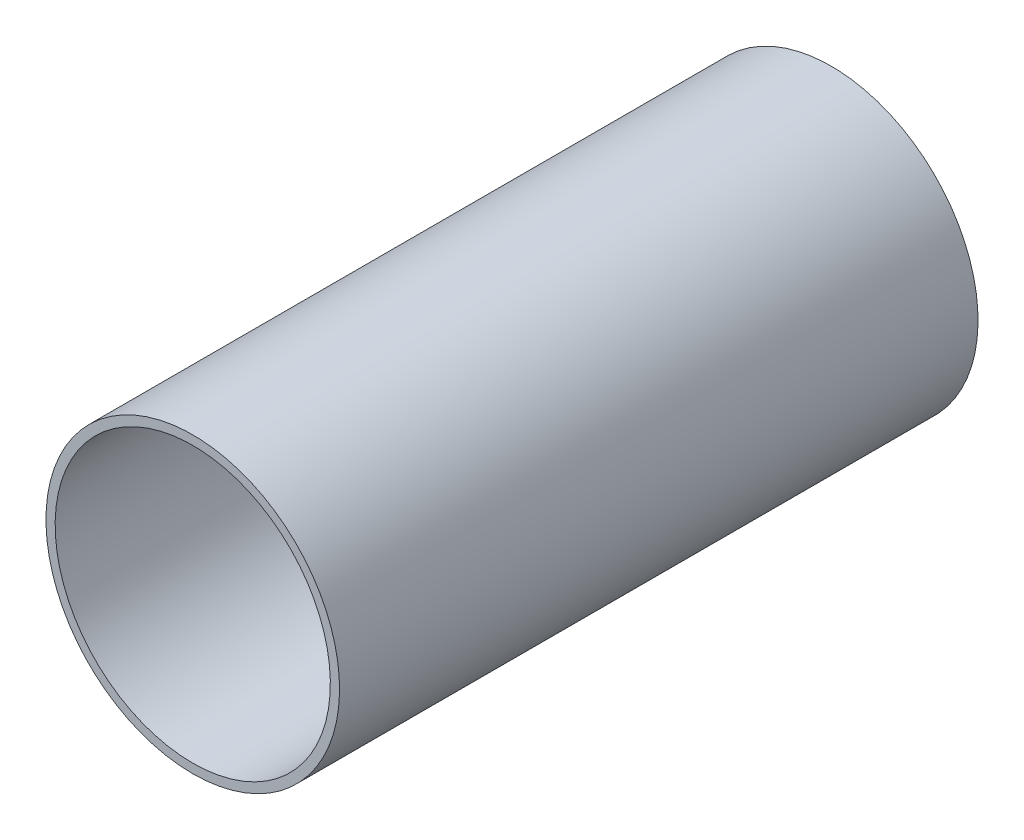
ISO-10303-21;
HEADER;
FILE_DESCRIPTION(('STEP AP214'),'2;1');
FILE_NAME('part.step','',(''),(''),'','','');
FILE_SCHEMA(('AUTOMOTIVE_DESIGN { 1 0 10303 214 1 1 1 1 }'));
ENDSEC;
DATA;
#1=APPLICATION_CONTEXT('core data for automotive mechanical design processes');
#2=APPLICATION_PROTOCOL_DEFINITION('international standard','automotive_design',2000,#1);
#3=PRODUCT_CONTEXT('',#1,'mechanical');
#4=PRODUCT('Part','Part','',(#3));
#5=PRODUCT_RELATED_PRODUCT_CATEGORY('part','',(#4));
#6=PRODUCT_DEFINITION_FORMATION('','',#4);
#7=PRODUCT_DEFINITION_CONTEXT('part definition',#1,'design');
#8=PRODUCT_DEFINITION('design','',#6,#7);
#9=PRODUCT_DEFINITION_SHAPE('','',#8);
#10=(LENGTH_UNIT() NAMED_UNIT(*) SI_UNIT(.MILLI.,.METRE.));
#11=(NAMED_UNIT(*) PLANE_ANGLE_UNIT() SI_UNIT($,.RADIAN.));
#12=(NAMED_UNIT(*) SI_UNIT($,.STERADIAN.) SOLID_ANGLE_UNIT());
#13=UNCERTAINTY_MEASURE_WITH_UNIT(LENGTH_MEASURE(1.E-05),#10,'distance_accuracy_value','');
#14=(GEOMETRIC_REPRESENTATION_CONTEXT(3) GLOBAL_UNCERTAINTY_ASSIGNED_CONTEXT((#13)) GLOBAL_UNIT_ASSIGNED_CONTEXT((#10,
#11,#12)) REPRESENTATION_CONTEXT('',''));
#15=CARTESIAN_POINT('',(0.,0.,0.));
#16=DIRECTION('',(0.,0.,1.));
#17=DIRECTION('',(1.,0.,0.));
#18=AXIS2_PLACEMENT_3D('',#15,#16,#17);
#19=CARTESIAN_POINT('',(165.09728,-80.77568,-0.045));
#20=DIRECTION('',(0.,0.,-1.));
#21=DIRECTION('',(0.,-1.,0.));
#22=AXIS2_PLACEMENT_3D('',#19,#20,#21);
#23=CYLINDRICAL_SURFACE('',#22,0.375);
#24=CARTESIAN_POINT('',(165.09728,-80.77568,-0.035));
#25=DIRECTION('',(0.,0.,-1.));
#26=DIRECTION('',(0.,-1.,0.));
#27=AXIS2_PLACEMENT_3D('',#24,#25,#26);
#28=CIRCLE('',#27,0.375);
#29=CARTESIAN_POINT('',(165.09728,-81.15068,-0.035));
#30=VERTEX_POINT('',#29);
#31=EDGE_CURVE('E64',#30,#30,#28,.T.);
#32=ORIENTED_EDGE('',*,*,#31,.T.);
#33=DIRECTION('',(0.,0.,1.));
#34=VECTOR('',#33,1.);
#35=CARTESIAN_POINT('',(165.09728,-81.15068,-0.045));
#36=LINE('',#35,#34);
#37=CARTESIAN_POINT('',(165.09728,-81.15068,1.705));
#38=VERTEX_POINT('',#37);
#39=EDGE_CURVE('E11',#30,#38,#36,.T.);
#40=ORIENTED_EDGE('',*,*,#39,.T.);
#41=CARTESIAN_POINT('',(165.09728,-80.77568,1.705));
#42=DIRECTION('',(0.,0.,-1.));
#43=DIRECTION('',(0.,-1.,0.));
#44=AXIS2_PLACEMENT_3D('',#41,#42,#43);
#45=CIRCLE('',#44,0.375);
#46=EDGE_CURVE('E25',#38,#38,#45,.T.);
#47=ORIENTED_EDGE('',*,*,#46,.F.);
#48=ORIENTED_EDGE('',*,*,#39,.F.);
#49=EDGE_LOOP('',(#32,#40,#47,#48));
#50=FACE_BOUND('',#49,.T.);
#51=ADVANCED_FACE('F17',(#50),#23,.F.);
#52=CARTESIAN_POINT('',(165.09728,-81.17568,1.705));
#53=DIRECTION('',(0.,0.,1.));
#54=DIRECTION('',(1.,0.,0.));
#55=AXIS2_PLACEMENT_3D('',#52,#53,#54);
#56=PLANE('',#55);
#57=ORIENTED_EDGE('',*,*,#46,.T.);
#58=EDGE_LOOP('',(#57));
#59=FACE_BOUND('',#58,.T.);
#60=CARTESIAN_POINT('',(165.09728,-80.77568,1.705));
#61=DIRECTION('',(0.,0.,1.));
#62=DIRECTION('',(0.,-1.,0.));
#63=AXIS2_PLACEMENT_3D('',#60,#61,#62);
#64=CIRCLE('',#63,0.4);
#65=CARTESIAN_POINT('',(165.09728,-81.17568,1.705));
#66=VERTEX_POINT('',#65);
#67=EDGE_CURVE('E56',#66,#66,#64,.T.);
#68=ORIENTED_EDGE('',*,*,#67,.T.);
#69=EDGE_LOOP('',(#68));
#70=FACE_BOUND('',#69,.T.);
#71=ADVANCED_FACE('F73',(#59,#70),#56,.T.);
#72=CARTESIAN_POINT('',(165.09728,-81.17568,-0.035));
#73=DIRECTION('',(0.,0.,1.));
#74=DIRECTION('',(1.,0.,0.));
#75=AXIS2_PLACEMENT_3D('',#72,#73,#74);
#76=PLANE('',#75);
#77=ORIENTED_EDGE('',*,*,#31,.F.);
#78=EDGE_LOOP('',(#77));
#79=FACE_BOUND('',#78,.T.);
#80=CARTESIAN_POINT('',(165.09728,-80.77568,-0.035));
#81=DIRECTION('',(0.,0.,1.));
#82=DIRECTION('',(0.,-1.,0.));
#83=AXIS2_PLACEMENT_3D('',#80,#81,#82);
#84=CIRCLE('',#83,0.4);
#85=CARTESIAN_POINT('',(165.09728,-81.17568,-0.035));
#86=VERTEX_POINT('',#85);
#87=EDGE_CURVE('E55',#86,#86,#84,.T.);
#88=ORIENTED_EDGE('',*,*,#87,.F.);
#89=EDGE_LOOP('',(#88));
#90=FACE_BOUND('',#89,.T.);
#91=ADVANCED_FACE('F82',(#79,#90),#76,.F.);
#92=CARTESIAN_POINT('',(165.09728,-80.77568,-0.035));
#93=DIRECTION('',(0.,0.,-1.));
#94=DIRECTION('',(0.,-1.,0.));
#95=AXIS2_PLACEMENT_3D('',#92,#93,#94);
#96=CYLINDRICAL_SURFACE('',#95,0.4);
#97=ORIENTED_EDGE('',*,*,#87,.T.);
#98=DIRECTION('',(0.,0.,1.));
#99=VECTOR('',#98,1.);
#100=CARTESIAN_POINT('',(165.09728,-81.17568,-0.035));
#101=LINE('',#100,#99);
#102=EDGE_CURVE('E52',#86,#66,#101,.T.);
#103=ORIENTED_EDGE('',*,*,#102,.T.);
#104=ORIENTED_EDGE('',*,*,#67,.F.);
#105=ORIENTED_EDGE('',*,*,#102,.F.);
#106=EDGE_LOOP('',(#97,#103,#104,#105));
#107=FACE_BOUND('',#106,.T.);
#108=ADVANCED_FACE('F53',(#107),#96,.T.);
#109=CLOSED_SHELL('',(#51,#71,#91,#108));
#110=MANIFOLD_SOLID_BREP('B1',#109);
#111=ADVANCED_BREP_SHAPE_REPRESENTATION('',(#18,#110),#14);
#112=SHAPE_DEFINITION_REPRESENTATION(#9,#111);
ENDSEC;
END-ISO-10303-21;
